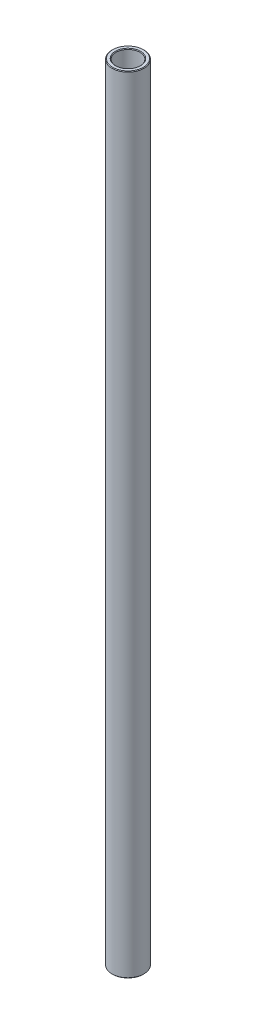
ISO-10303-21;
HEADER;
FILE_DESCRIPTION(('STEP AP214'),'2;1');
FILE_NAME('part.step','',(''),(''),'','','');
FILE_SCHEMA(('AUTOMOTIVE_DESIGN { 1 0 10303 214 1 1 1 1 }'));
ENDSEC;
DATA;
#1=APPLICATION_CONTEXT('core data for automotive mechanical design processes');
#2=APPLICATION_PROTOCOL_DEFINITION('international standard','automotive_design',2000,#1);
#3=PRODUCT_CONTEXT('',#1,'mechanical');
#4=PRODUCT('Part','Part','',(#3));
#5=PRODUCT_RELATED_PRODUCT_CATEGORY('part','',(#4));
#6=PRODUCT_DEFINITION_FORMATION('','',#4);
#7=PRODUCT_DEFINITION_CONTEXT('part definition',#1,'design');
#8=PRODUCT_DEFINITION('design','',#6,#7);
#9=PRODUCT_DEFINITION_SHAPE('','',#8);
#10=(LENGTH_UNIT() NAMED_UNIT(*) SI_UNIT(.MILLI.,.METRE.));
#11=(NAMED_UNIT(*) PLANE_ANGLE_UNIT() SI_UNIT($,.RADIAN.));
#12=(NAMED_UNIT(*) SI_UNIT($,.STERADIAN.) SOLID_ANGLE_UNIT());
#13=UNCERTAINTY_MEASURE_WITH_UNIT(LENGTH_MEASURE(1.E-05),#10,'distance_accuracy_value','');
#14=(GEOMETRIC_REPRESENTATION_CONTEXT(3) GLOBAL_UNCERTAINTY_ASSIGNED_CONTEXT((#13)) GLOBAL_UNIT_ASSIGNED_CONTEXT((#10,
#11,#12)) REPRESENTATION_CONTEXT('',''));
#15=CARTESIAN_POINT('',(0.,0.,0.));
#16=DIRECTION('',(0.,0.,1.));
#17=DIRECTION('',(1.,0.,0.));
#18=AXIS2_PLACEMENT_3D('',#15,#16,#17);
#19=CARTESIAN_POINT('',(0.,11.60859375,0.));
#20=DIRECTION('',(0.,1.,0.));
#21=DIRECTION('',(-1.,0.,0.));
#22=AXIS2_PLACEMENT_3D('',#19,#20,#21);
#23=CYLINDRICAL_SURFACE('',#22,4.7625);
#24=CARTESIAN_POINT('',(0.,-156.511625,0.));
#25=DIRECTION('',(0.,1.,0.));
#26=DIRECTION('',(-1.,0.,0.));
#27=AXIS2_PLACEMENT_3D('',#24,#25,#26);
#28=CIRCLE('',#27,4.7625);
#29=CARTESIAN_POINT('',(-4.76250000000002,-156.511625,0.));
#30=VERTEX_POINT('',#29);
#31=EDGE_CURVE('E50',#30,#30,#28,.F.);
#32=ORIENTED_EDGE('',*,*,#31,.T.);
#33=EDGE_LOOP('',(#32));
#34=FACE_BOUND('',#33,.T.);
#35=CARTESIAN_POINT('',(0.,156.511625,0.));
#36=DIRECTION('',(0.,-1.,0.));
#37=DIRECTION('',(1.,0.,0.));
#38=AXIS2_PLACEMENT_3D('',#35,#36,#37);
#39=CIRCLE('',#38,4.7625);
#40=CARTESIAN_POINT('',(4.76250000000002,156.511625,0.));
#41=VERTEX_POINT('',#40);
#42=EDGE_CURVE('E53',#41,#41,#39,.F.);
#43=ORIENTED_EDGE('',*,*,#42,.T.);
#44=EDGE_LOOP('',(#43));
#45=FACE_BOUND('',#44,.T.);
#46=ADVANCED_FACE('F30',(#34,#45),#23,.F.);
#47=CARTESIAN_POINT('',(4.76249999999998,156.765625,0.));
#48=DIRECTION('',(0.,-1.,0.));
#49=DIRECTION('',(1.,0.,0.));
#50=AXIS2_PLACEMENT_3D('',#47,#48,#49);
#51=PLANE('',#50);
#52=CARTESIAN_POINT('',(0.,156.765625,0.));
#53=DIRECTION('',(0.,-1.,0.));
#54=DIRECTION('',(1.,0.,0.));
#55=AXIS2_PLACEMENT_3D('',#52,#53,#54);
#56=CIRCLE('',#55,6.09599999999996);
#57=CARTESIAN_POINT('',(6.09599999999998,156.765625,0.));
#58=VERTEX_POINT('',#57);
#59=EDGE_CURVE('E10',#58,#58,#56,.F.);
#60=ORIENTED_EDGE('',*,*,#59,.T.);
#61=EDGE_LOOP('',(#60));
#62=FACE_BOUND('',#61,.T.);
#63=CARTESIAN_POINT('',(0.,156.765625,0.));
#64=DIRECTION('',(0.,-1.,0.));
#65=DIRECTION('',(1.,0.,0.));
#66=AXIS2_PLACEMENT_3D('',#63,#64,#65);
#67=CIRCLE('',#66,5.01650000000006);
#68=CARTESIAN_POINT('',(5.01650000000008,156.765625,0.));
#69=VERTEX_POINT('',#68);
#70=EDGE_CURVE('E37',#69,#69,#67,.T.);
#71=ORIENTED_EDGE('',*,*,#70,.T.);
#72=EDGE_LOOP('',(#71));
#73=FACE_BOUND('',#72,.T.);
#74=ADVANCED_FACE('F76',(#62,#73),#51,.F.);
#75=CARTESIAN_POINT('',(0.,11.60859375,0.));
#76=DIRECTION('',(0.,1.,0.));
#77=DIRECTION('',(-1.,0.,0.));
#78=AXIS2_PLACEMENT_3D('',#75,#76,#77);
#79=CYLINDRICAL_SURFACE('',#78,6.35);
#80=CARTESIAN_POINT('',(0.,-156.511625,0.));
#81=DIRECTION('',(0.,1.,0.));
#82=DIRECTION('',(-1.,0.,0.));
#83=AXIS2_PLACEMENT_3D('',#80,#81,#82);
#84=CIRCLE('',#83,6.35);
#85=CARTESIAN_POINT('',(-6.35000000000002,-156.511625,0.));
#86=VERTEX_POINT('',#85);
#87=EDGE_CURVE('E41',#86,#86,#84,.T.);
#88=ORIENTED_EDGE('',*,*,#87,.T.);
#89=EDGE_LOOP('',(#88));
#90=FACE_BOUND('',#89,.T.);
#91=CARTESIAN_POINT('',(0.,156.511625,0.));
#92=DIRECTION('',(0.,-1.,0.));
#93=DIRECTION('',(1.,0.,0.));
#94=AXIS2_PLACEMENT_3D('',#91,#92,#93);
#95=CIRCLE('',#94,6.35);
#96=CARTESIAN_POINT('',(6.35000000000002,156.511625,0.));
#97=VERTEX_POINT('',#96);
#98=EDGE_CURVE('E45',#97,#97,#95,.T.);
#99=ORIENTED_EDGE('',*,*,#98,.T.);
#100=EDGE_LOOP('',(#99));
#101=FACE_BOUND('',#100,.T.);
#102=ADVANCED_FACE('F73',(#90,#101),#79,.T.);
#103=CARTESIAN_POINT('',(6.35000000000002,-156.765625,0.));
#104=DIRECTION('',(0.,1.,0.));
#105=DIRECTION('',(-1.,0.,0.));
#106=AXIS2_PLACEMENT_3D('',#103,#104,#105);
#107=PLANE('',#106);
#108=CARTESIAN_POINT('',(0.,-156.765625,0.));
#109=DIRECTION('',(0.,1.,0.));
#110=DIRECTION('',(-1.,0.,0.));
#111=AXIS2_PLACEMENT_3D('',#108,#109,#110);
#112=CIRCLE('',#111,5.01649999999998);
#113=CARTESIAN_POINT('',(-5.0165,-156.765625,0.));
#114=VERTEX_POINT('',#113);
#115=EDGE_CURVE('E56',#114,#114,#112,.T.);
#116=ORIENTED_EDGE('',*,*,#115,.T.);
#117=EDGE_LOOP('',(#116));
#118=FACE_BOUND('',#117,.T.);
#119=CARTESIAN_POINT('',(0.,-156.765625,0.));
#120=DIRECTION('',(0.,1.,0.));
#121=DIRECTION('',(-1.,0.,0.));
#122=AXIS2_PLACEMENT_3D('',#119,#120,#121);
#123=CIRCLE('',#122,6.09599999999993);
#124=CARTESIAN_POINT('',(-6.09599999999995,-156.765625,0.));
#125=VERTEX_POINT('',#124);
#126=EDGE_CURVE('E59',#125,#125,#123,.F.);
#127=ORIENTED_EDGE('',*,*,#126,.T.);
#128=EDGE_LOOP('',(#127));
#129=FACE_BOUND('',#128,.T.);
#130=ADVANCED_FACE('F63',(#118,#129),#107,.F.);
#131=CARTESIAN_POINT('',(0.,-156.765625,0.));
#132=DIRECTION('',(0.,-1.,0.));
#133=DIRECTION('',(1.,0.,0.));
#134=AXIS2_PLACEMENT_3D('',#131,#132,#133);
#135=CONICAL_SURFACE('',#134,5.01649999999998,0.78539816339745);
#136=ORIENTED_EDGE('',*,*,#31,.F.);
#137=EDGE_LOOP('',(#136));
#138=FACE_BOUND('',#137,.T.);
#139=ORIENTED_EDGE('',*,*,#115,.F.);
#140=EDGE_LOOP('',(#139));
#141=FACE_BOUND('',#140,.T.);
#142=ADVANCED_FACE('F69',(#138,#141),#135,.F.);
#143=CARTESIAN_POINT('',(0.,-156.511625,0.));
#144=DIRECTION('',(0.,1.,0.));
#145=DIRECTION('',(-1.,0.,0.));
#146=AXIS2_PLACEMENT_3D('',#143,#144,#145);
#147=CONICAL_SURFACE('',#146,6.35,0.78539816339746);
#148=ORIENTED_EDGE('',*,*,#126,.F.);
#149=EDGE_LOOP('',(#148));
#150=FACE_BOUND('',#149,.T.);
#151=ORIENTED_EDGE('',*,*,#87,.F.);
#152=EDGE_LOOP('',(#151));
#153=FACE_BOUND('',#152,.T.);
#154=ADVANCED_FACE('F65',(#150,#153),#147,.T.);
#155=CARTESIAN_POINT('',(0.,156.765625,0.));
#156=DIRECTION('',(0.,-1.,0.));
#157=DIRECTION('',(1.,0.,0.));
#158=AXIS2_PLACEMENT_3D('',#155,#156,#157);
#159=CONICAL_SURFACE('',#158,6.09599999999996,0.785398163397515);
#160=ORIENTED_EDGE('',*,*,#98,.F.);
#161=EDGE_LOOP('',(#160));
#162=FACE_BOUND('',#161,.T.);
#163=ORIENTED_EDGE('',*,*,#59,.F.);
#164=EDGE_LOOP('',(#163));
#165=FACE_BOUND('',#164,.T.);
#166=ADVANCED_FACE('F68',(#162,#165),#159,.T.);
#167=CARTESIAN_POINT('',(0.,156.511625,0.));
#168=DIRECTION('',(0.,1.,0.));
#169=DIRECTION('',(-1.,0.,0.));
#170=AXIS2_PLACEMENT_3D('',#167,#168,#169);
#171=CONICAL_SURFACE('',#170,4.7625,0.78539816339745);
#172=ORIENTED_EDGE('',*,*,#70,.F.);
#173=EDGE_LOOP('',(#172));
#174=FACE_BOUND('',#173,.T.);
#175=ORIENTED_EDGE('',*,*,#42,.F.);
#176=EDGE_LOOP('',(#175));
#177=FACE_BOUND('',#176,.T.);
#178=ADVANCED_FACE('F32',(#174,#177),#171,.F.);
#179=CLOSED_SHELL('',(#46,#74,#102,#130,#142,#154,#166,#178));
#180=MANIFOLD_SOLID_BREP('B2',#179);
#181=ADVANCED_BREP_SHAPE_REPRESENTATION('',(#18,#180),#14);
#182=SHAPE_DEFINITION_REPRESENTATION(#9,#181);
ENDSEC;
END-ISO-10303-21;
